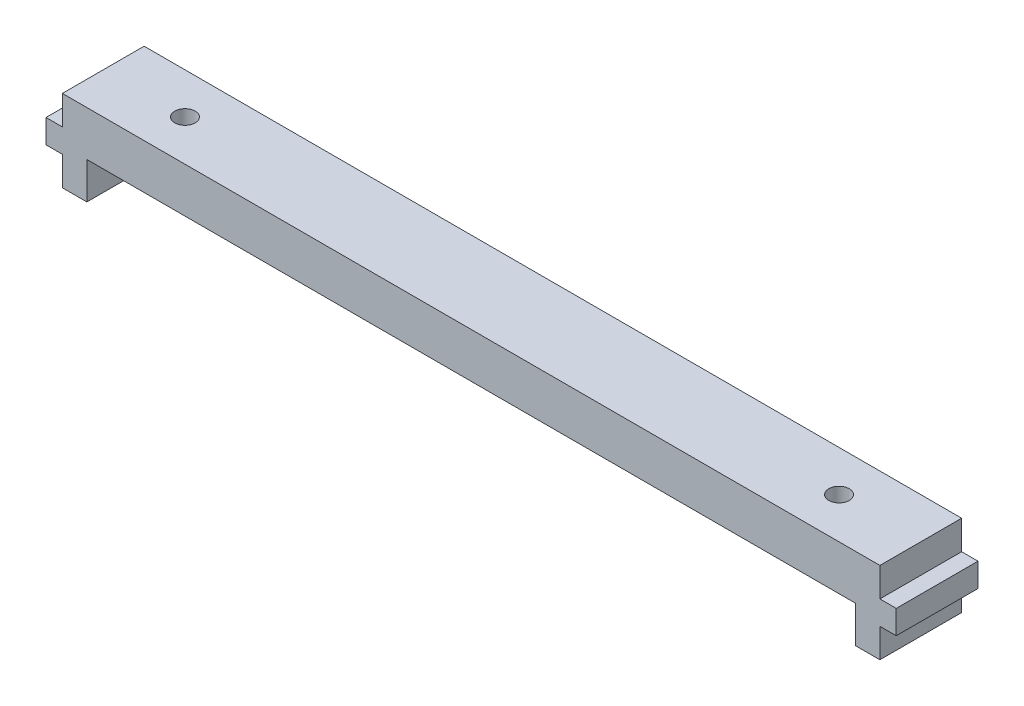
ISO-10303-21;
HEADER;
FILE_DESCRIPTION(('STEP AP214'),'2;1');
FILE_NAME('part.step','',(''),(''),'','','');
FILE_SCHEMA(('AUTOMOTIVE_DESIGN { 1 0 10303 214 1 1 1 1 }'));
ENDSEC;
DATA;
#1=APPLICATION_CONTEXT('core data for automotive mechanical design processes');
#2=APPLICATION_PROTOCOL_DEFINITION('international standard','automotive_design',2000,#1);
#3=PRODUCT_CONTEXT('',#1,'mechanical');
#4=PRODUCT('Part','Part','',(#3));
#5=PRODUCT_RELATED_PRODUCT_CATEGORY('part','',(#4));
#6=PRODUCT_DEFINITION_FORMATION('','',#4);
#7=PRODUCT_DEFINITION_CONTEXT('part definition',#1,'design');
#8=PRODUCT_DEFINITION('design','',#6,#7);
#9=PRODUCT_DEFINITION_SHAPE('','',#8);
#10=(LENGTH_UNIT() NAMED_UNIT(*) SI_UNIT(.MILLI.,.METRE.));
#11=(NAMED_UNIT(*) PLANE_ANGLE_UNIT() SI_UNIT($,.RADIAN.));
#12=(NAMED_UNIT(*) SI_UNIT($,.STERADIAN.) SOLID_ANGLE_UNIT());
#13=UNCERTAINTY_MEASURE_WITH_UNIT(LENGTH_MEASURE(1.E-05),#10,'distance_accuracy_value','');
#14=(GEOMETRIC_REPRESENTATION_CONTEXT(3) GLOBAL_UNCERTAINTY_ASSIGNED_CONTEXT((#13)) GLOBAL_UNIT_ASSIGNED_CONTEXT((#10,
#11,#12)) REPRESENTATION_CONTEXT('',''));
#15=CARTESIAN_POINT('',(0.,0.,0.));
#16=DIRECTION('',(0.,0.,1.));
#17=DIRECTION('',(1.,0.,0.));
#18=AXIS2_PLACEMENT_3D('',#15,#16,#17);
#19=CARTESIAN_POINT('',(-50.,5.5,10.));
#20=DIRECTION('',(0.,-1.,0.));
#21=DIRECTION('',(1.,0.,0.));
#22=AXIS2_PLACEMENT_3D('',#19,#20,#21);
#23=PLANE('',#22);
#24=CARTESIAN_POINT('',(40.,5.5,5.));
#25=DIRECTION('',(0.,1.,0.));
#26=DIRECTION('',(0.,0.,-1.));
#27=AXIS2_PLACEMENT_3D('',#24,#25,#26);
#28=CIRCLE('',#27,1.25);
#29=CARTESIAN_POINT('',(40.,5.5,3.75));
#30=VERTEX_POINT('',#29);
#31=EDGE_CURVE('E238',#30,#30,#28,.T.);
#32=ORIENTED_EDGE('',*,*,#31,.F.);
#33=EDGE_LOOP('',(#32));
#34=FACE_BOUND('',#33,.T.);
#35=CARTESIAN_POINT('',(-40.,5.5,5.));
#36=DIRECTION('',(0.,-1.,0.));
#37=DIRECTION('',(0.,0.,-1.));
#38=AXIS2_PLACEMENT_3D('',#35,#36,#37);
#39=CIRCLE('',#38,1.25);
#40=CARTESIAN_POINT('',(-40.,5.5,3.75));
#41=VERTEX_POINT('',#40);
#42=EDGE_CURVE('E139',#41,#41,#39,.T.);
#43=ORIENTED_EDGE('',*,*,#42,.T.);
#44=EDGE_LOOP('',(#43));
#45=FACE_BOUND('',#44,.T.);
#46=DIRECTION('',(-1.,0.,0.));
#47=VECTOR('',#46,1.);
#48=CARTESIAN_POINT('',(-50.,5.5,0.));
#49=LINE('',#48,#47);
#50=CARTESIAN_POINT('',(50.,5.5,0.));
#51=VERTEX_POINT('',#50);
#52=CARTESIAN_POINT('',(-50.,5.5,0.));
#53=VERTEX_POINT('',#52);
#54=EDGE_CURVE('E135',#51,#53,#49,.T.);
#55=ORIENTED_EDGE('',*,*,#54,.T.);
#56=DIRECTION('',(0.,0.,-1.));
#57=VECTOR('',#56,1.);
#58=CARTESIAN_POINT('',(-50.,5.5,10.));
#59=LINE('',#58,#57);
#60=CARTESIAN_POINT('',(-50.,5.5,10.));
#61=VERTEX_POINT('',#60);
#62=EDGE_CURVE('E11',#61,#53,#59,.T.);
#63=ORIENTED_EDGE('',*,*,#62,.F.);
#64=DIRECTION('',(-1.,0.,0.));
#65=VECTOR('',#64,1.);
#66=CARTESIAN_POINT('',(-50.,5.5,10.));
#67=LINE('',#66,#65);
#68=CARTESIAN_POINT('',(50.,5.5,10.));
#69=VERTEX_POINT('',#68);
#70=EDGE_CURVE('E153',#69,#61,#67,.T.);
#71=ORIENTED_EDGE('',*,*,#70,.F.);
#72=DIRECTION('',(0.,0.,-1.));
#73=VECTOR('',#72,1.);
#74=CARTESIAN_POINT('',(50.,5.5,10.));
#75=LINE('',#74,#73);
#76=EDGE_CURVE('E212',#69,#51,#75,.T.);
#77=ORIENTED_EDGE('',*,*,#76,.T.);
#78=EDGE_LOOP('',(#55,#63,#71,#77));
#79=FACE_BOUND('',#78,.T.);
#80=ADVANCED_FACE('F32',(#34,#45,#79),#23,.F.);
#81=CARTESIAN_POINT('',(-50.,5.5,10.));
#82=DIRECTION('',(1.,0.,0.));
#83=DIRECTION('',(0.,0.,-1.));
#84=AXIS2_PLACEMENT_3D('',#81,#82,#83);
#85=PLANE('',#84);
#86=DIRECTION('',(0.,-1.,0.));
#87=VECTOR('',#86,1.);
#88=CARTESIAN_POINT('',(-50.,5.5,0.));
#89=LINE('',#88,#87);
#90=CARTESIAN_POINT('',(-50.,1.95,0.));
#91=VERTEX_POINT('',#90);
#92=EDGE_CURVE('E138',#53,#91,#89,.T.);
#93=ORIENTED_EDGE('',*,*,#92,.T.);
#94=DIRECTION('',(0.,0.,-1.));
#95=VECTOR('',#94,1.);
#96=CARTESIAN_POINT('',(-50.,1.95,10.));
#97=LINE('',#96,#95);
#98=CARTESIAN_POINT('',(-50.,1.95,10.));
#99=VERTEX_POINT('',#98);
#100=EDGE_CURVE('E40',#99,#91,#97,.T.);
#101=ORIENTED_EDGE('',*,*,#100,.F.);
#102=DIRECTION('',(0.,-1.,0.));
#103=VECTOR('',#102,1.);
#104=CARTESIAN_POINT('',(-50.,5.5,10.));
#105=LINE('',#104,#103);
#106=EDGE_CURVE('E92',#61,#99,#105,.T.);
#107=ORIENTED_EDGE('',*,*,#106,.F.);
#108=ORIENTED_EDGE('',*,*,#62,.T.);
#109=EDGE_LOOP('',(#93,#101,#107,#108));
#110=FACE_BOUND('',#109,.T.);
#111=ADVANCED_FACE('F269',(#110),#85,.F.);
#112=CARTESIAN_POINT('',(-50.,1.95,10.));
#113=DIRECTION('',(0.,-1.,0.));
#114=DIRECTION('',(1.,0.,0.));
#115=AXIS2_PLACEMENT_3D('',#112,#113,#114);
#116=PLANE('',#115);
#117=DIRECTION('',(-1.,0.,0.));
#118=VECTOR('',#117,1.);
#119=CARTESIAN_POINT('',(-50.,1.95,0.));
#120=LINE('',#119,#118);
#121=CARTESIAN_POINT('',(-52.,1.95,0.));
#122=VERTEX_POINT('',#121);
#123=EDGE_CURVE('E141',#91,#122,#120,.T.);
#124=ORIENTED_EDGE('',*,*,#123,.T.);
#125=DIRECTION('',(0.,0.,-1.));
#126=VECTOR('',#125,1.);
#127=CARTESIAN_POINT('',(-52.,1.95,10.));
#128=LINE('',#127,#126);
#129=CARTESIAN_POINT('',(-52.,1.95,10.));
#130=VERTEX_POINT('',#129);
#131=EDGE_CURVE('E160',#130,#122,#128,.T.);
#132=ORIENTED_EDGE('',*,*,#131,.F.);
#133=DIRECTION('',(-1.,0.,0.));
#134=VECTOR('',#133,1.);
#135=CARTESIAN_POINT('',(-50.,1.95,10.));
#136=LINE('',#135,#134);
#137=EDGE_CURVE('E168',#99,#130,#136,.T.);
#138=ORIENTED_EDGE('',*,*,#137,.F.);
#139=ORIENTED_EDGE('',*,*,#100,.T.);
#140=EDGE_LOOP('',(#124,#132,#138,#139));
#141=FACE_BOUND('',#140,.T.);
#142=ADVANCED_FACE('F166',(#141),#116,.F.);
#143=CARTESIAN_POINT('',(-52.,1.95,10.));
#144=DIRECTION('',(1.,0.,0.));
#145=DIRECTION('',(0.,0.,-1.));
#146=AXIS2_PLACEMENT_3D('',#143,#144,#145);
#147=PLANE('',#146);
#148=DIRECTION('',(0.,-1.,0.));
#149=VECTOR('',#148,1.);
#150=CARTESIAN_POINT('',(-52.,1.95,0.));
#151=LINE('',#150,#149);
#152=CARTESIAN_POINT('',(-52.,-0.949999999999999,0.));
#153=VERTEX_POINT('',#152);
#154=EDGE_CURVE('E143',#122,#153,#151,.T.);
#155=ORIENTED_EDGE('',*,*,#154,.T.);
#156=DIRECTION('',(0.,0.,-1.));
#157=VECTOR('',#156,1.);
#158=CARTESIAN_POINT('',(-52.,-0.949999999999999,10.));
#159=LINE('',#158,#157);
#160=CARTESIAN_POINT('',(-52.,-0.949999999999999,10.));
#161=VERTEX_POINT('',#160);
#162=EDGE_CURVE('E157',#161,#153,#159,.T.);
#163=ORIENTED_EDGE('',*,*,#162,.F.);
#164=DIRECTION('',(0.,-1.,0.));
#165=VECTOR('',#164,1.);
#166=CARTESIAN_POINT('',(-52.,1.95,10.));
#167=LINE('',#166,#165);
#168=EDGE_CURVE('E180',#130,#161,#167,.T.);
#169=ORIENTED_EDGE('',*,*,#168,.F.);
#170=ORIENTED_EDGE('',*,*,#131,.T.);
#171=EDGE_LOOP('',(#155,#163,#169,#170));
#172=FACE_BOUND('',#171,.T.);
#173=ADVANCED_FACE('F176',(#172),#147,.F.);
#174=CARTESIAN_POINT('',(-52.,-0.949999999999999,10.));
#175=DIRECTION('',(0.,1.,0.));
#176=DIRECTION('',(-1.,0.,0.));
#177=AXIS2_PLACEMENT_3D('',#174,#175,#176);
#178=PLANE('',#177);
#179=DIRECTION('',(1.,0.,0.));
#180=VECTOR('',#179,1.);
#181=CARTESIAN_POINT('',(-52.,-0.949999999999999,0.));
#182=LINE('',#181,#180);
#183=CARTESIAN_POINT('',(-50.,-0.949999999999999,0.));
#184=VERTEX_POINT('',#183);
#185=EDGE_CURVE('E145',#153,#184,#182,.T.);
#186=ORIENTED_EDGE('',*,*,#185,.T.);
#187=DIRECTION('',(0.,0.,-1.));
#188=VECTOR('',#187,1.);
#189=CARTESIAN_POINT('',(-50.,-0.949999999999999,10.));
#190=LINE('',#189,#188);
#191=CARTESIAN_POINT('',(-50.,-0.949999999999999,10.));
#192=VERTEX_POINT('',#191);
#193=EDGE_CURVE('E124',#192,#184,#190,.T.);
#194=ORIENTED_EDGE('',*,*,#193,.F.);
#195=DIRECTION('',(1.,0.,0.));
#196=VECTOR('',#195,1.);
#197=CARTESIAN_POINT('',(-52.,-0.949999999999999,10.));
#198=LINE('',#197,#196);
#199=EDGE_CURVE('E115',#161,#192,#198,.T.);
#200=ORIENTED_EDGE('',*,*,#199,.F.);
#201=ORIENTED_EDGE('',*,*,#162,.T.);
#202=EDGE_LOOP('',(#186,#194,#200,#201));
#203=FACE_BOUND('',#202,.T.);
#204=ADVANCED_FACE('F179',(#203),#178,.F.);
#205=CARTESIAN_POINT('',(-50.,-0.949999999999999,10.));
#206=DIRECTION('',(1.,0.,0.));
#207=DIRECTION('',(0.,0.,-1.));
#208=AXIS2_PLACEMENT_3D('',#205,#206,#207);
#209=PLANE('',#208);
#210=DIRECTION('',(0.,-1.,0.));
#211=VECTOR('',#210,1.);
#212=CARTESIAN_POINT('',(-50.,-0.949999999999999,0.));
#213=LINE('',#212,#211);
#214=CARTESIAN_POINT('',(-50.,-4.5,0.));
#215=VERTEX_POINT('',#214);
#216=EDGE_CURVE('E123',#184,#215,#213,.T.);
#217=ORIENTED_EDGE('',*,*,#216,.T.);
#218=DIRECTION('',(0.,0.,-1.));
#219=VECTOR('',#218,1.);
#220=CARTESIAN_POINT('',(-50.,-4.5,10.));
#221=LINE('',#220,#219);
#222=CARTESIAN_POINT('',(-50.,-4.5,10.));
#223=VERTEX_POINT('',#222);
#224=EDGE_CURVE('E120',#223,#215,#221,.T.);
#225=ORIENTED_EDGE('',*,*,#224,.F.);
#226=DIRECTION('',(0.,-1.,0.));
#227=VECTOR('',#226,1.);
#228=CARTESIAN_POINT('',(-50.,-0.949999999999999,10.));
#229=LINE('',#228,#227);
#230=EDGE_CURVE('E109',#192,#223,#229,.T.);
#231=ORIENTED_EDGE('',*,*,#230,.F.);
#232=ORIENTED_EDGE('',*,*,#193,.T.);
#233=EDGE_LOOP('',(#217,#225,#231,#232));
#234=FACE_BOUND('',#233,.T.);
#235=ADVANCED_FACE('F121',(#234),#209,.F.);
#236=CARTESIAN_POINT('',(-50.,-4.5,10.));
#237=DIRECTION('',(0.,1.,0.));
#238=DIRECTION('',(-1.,0.,0.));
#239=AXIS2_PLACEMENT_3D('',#236,#237,#238);
#240=PLANE('',#239);
#241=DIRECTION('',(1.,0.,0.));
#242=VECTOR('',#241,1.);
#243=CARTESIAN_POINT('',(-50.,-4.5,0.));
#244=LINE('',#243,#242);
#245=CARTESIAN_POINT('',(-47.,-4.5,0.));
#246=VERTEX_POINT('',#245);
#247=EDGE_CURVE('E78',#215,#246,#244,.T.);
#248=ORIENTED_EDGE('',*,*,#247,.T.);
#249=DIRECTION('',(0.,0.,-1.));
#250=VECTOR('',#249,1.);
#251=CARTESIAN_POINT('',(-47.,-4.5,10.));
#252=LINE('',#251,#250);
#253=CARTESIAN_POINT('',(-47.,-4.5,10.));
#254=VERTEX_POINT('',#253);
#255=EDGE_CURVE('E125',#254,#246,#252,.T.);
#256=ORIENTED_EDGE('',*,*,#255,.F.);
#257=DIRECTION('',(1.,0.,0.));
#258=VECTOR('',#257,1.);
#259=CARTESIAN_POINT('',(-50.,-4.5,10.));
#260=LINE('',#259,#258);
#261=EDGE_CURVE('E113',#223,#254,#260,.T.);
#262=ORIENTED_EDGE('',*,*,#261,.F.);
#263=ORIENTED_EDGE('',*,*,#224,.T.);
#264=EDGE_LOOP('',(#248,#256,#262,#263));
#265=FACE_BOUND('',#264,.T.);
#266=ADVANCED_FACE('F127',(#265),#240,.F.);
#267=CARTESIAN_POINT('',(-47.,-4.5,10.));
#268=DIRECTION('',(-1.,0.,0.));
#269=DIRECTION('',(0.,0.,1.));
#270=AXIS2_PLACEMENT_3D('',#267,#268,#269);
#271=PLANE('',#270);
#272=DIRECTION('',(0.,1.,0.));
#273=VECTOR('',#272,1.);
#274=CARTESIAN_POINT('',(-47.,-4.5,0.));
#275=LINE('',#274,#273);
#276=CARTESIAN_POINT('',(-47.,0.,0.));
#277=VERTEX_POINT('',#276);
#278=EDGE_CURVE('E84',#246,#277,#275,.T.);
#279=ORIENTED_EDGE('',*,*,#278,.T.);
#280=DIRECTION('',(0.,0.,-1.));
#281=VECTOR('',#280,1.);
#282=CARTESIAN_POINT('',(-47.,0.,10.));
#283=LINE('',#282,#281);
#284=CARTESIAN_POINT('',(-47.,0.,10.));
#285=VERTEX_POINT('',#284);
#286=EDGE_CURVE('E134',#285,#277,#283,.T.);
#287=ORIENTED_EDGE('',*,*,#286,.F.);
#288=DIRECTION('',(0.,1.,0.));
#289=VECTOR('',#288,1.);
#290=CARTESIAN_POINT('',(-47.,-4.5,10.));
#291=LINE('',#290,#289);
#292=EDGE_CURVE('E48',#254,#285,#291,.T.);
#293=ORIENTED_EDGE('',*,*,#292,.F.);
#294=ORIENTED_EDGE('',*,*,#255,.T.);
#295=EDGE_LOOP('',(#279,#287,#293,#294));
#296=FACE_BOUND('',#295,.T.);
#297=ADVANCED_FACE('F341',(#296),#271,.F.);
#298=CARTESIAN_POINT('',(-47.,0.,10.));
#299=DIRECTION('',(0.,1.,0.));
#300=DIRECTION('',(0.,0.,1.));
#301=AXIS2_PLACEMENT_3D('',#298,#299,#300);
#302=PLANE('',#301);
#303=CARTESIAN_POINT('',(40.,0.,5.));
#304=DIRECTION('',(0.,1.,0.));
#305=DIRECTION('',(0.,0.,-1.));
#306=AXIS2_PLACEMENT_3D('',#303,#304,#305);
#307=CIRCLE('',#306,1.25);
#308=CARTESIAN_POINT('',(40.,0.,3.75));
#309=VERTEX_POINT('',#308);
#310=EDGE_CURVE('E258',#309,#309,#307,.T.);
#311=ORIENTED_EDGE('',*,*,#310,.T.);
#312=EDGE_LOOP('',(#311));
#313=FACE_BOUND('',#312,.T.);
#314=CARTESIAN_POINT('',(-40.,0.,5.));
#315=DIRECTION('',(0.,-1.,0.));
#316=DIRECTION('',(0.,0.,-1.));
#317=AXIS2_PLACEMENT_3D('',#314,#315,#316);
#318=CIRCLE('',#317,1.25);
#319=CARTESIAN_POINT('',(-40.,0.,3.75));
#320=VERTEX_POINT('',#319);
#321=EDGE_CURVE('E186',#320,#320,#318,.T.);
#322=ORIENTED_EDGE('',*,*,#321,.F.);
#323=EDGE_LOOP('',(#322));
#324=FACE_BOUND('',#323,.T.);
#325=DIRECTION('',(1.,0.,0.));
#326=VECTOR('',#325,1.);
#327=CARTESIAN_POINT('',(-47.,0.,0.));
#328=LINE('',#327,#326);
#329=CARTESIAN_POINT('',(47.,0.,0.));
#330=VERTEX_POINT('',#329);
#331=EDGE_CURVE('E150',#277,#330,#328,.T.);
#332=ORIENTED_EDGE('',*,*,#331,.T.);
#333=DIRECTION('',(0.,0.,-1.));
#334=VECTOR('',#333,1.);
#335=CARTESIAN_POINT('',(47.,0.,10.));
#336=LINE('',#335,#334);
#337=CARTESIAN_POINT('',(47.,0.,10.));
#338=VERTEX_POINT('',#337);
#339=EDGE_CURVE('E189',#338,#330,#336,.T.);
#340=ORIENTED_EDGE('',*,*,#339,.F.);
#341=DIRECTION('',(1.,0.,0.));
#342=VECTOR('',#341,1.);
#343=CARTESIAN_POINT('',(-47.,0.,10.));
#344=LINE('',#343,#342);
#345=EDGE_CURVE('E129',#285,#338,#344,.T.);
#346=ORIENTED_EDGE('',*,*,#345,.F.);
#347=ORIENTED_EDGE('',*,*,#286,.T.);
#348=EDGE_LOOP('',(#332,#340,#346,#347));
#349=FACE_BOUND('',#348,.T.);
#350=ADVANCED_FACE('F340',(#313,#324,#349),#302,.F.);
#351=CARTESIAN_POINT('',(0.,0.,10.));
#352=DIRECTION('',(0.,0.,-1.));
#353=DIRECTION('',(-1.,0.,0.));
#354=AXIS2_PLACEMENT_3D('',#351,#352,#353);
#355=PLANE('',#354);
#356=ORIENTED_EDGE('',*,*,#70,.T.);
#357=ORIENTED_EDGE('',*,*,#106,.T.);
#358=ORIENTED_EDGE('',*,*,#137,.T.);
#359=ORIENTED_EDGE('',*,*,#168,.T.);
#360=ORIENTED_EDGE('',*,*,#199,.T.);
#361=ORIENTED_EDGE('',*,*,#230,.T.);
#362=ORIENTED_EDGE('',*,*,#261,.T.);
#363=ORIENTED_EDGE('',*,*,#292,.T.);
#364=ORIENTED_EDGE('',*,*,#345,.T.);
#365=DIRECTION('',(0.,1.,0.));
#366=VECTOR('',#365,1.);
#367=CARTESIAN_POINT('',(47.,-4.5,10.));
#368=LINE('',#367,#366);
#369=CARTESIAN_POINT('',(47.,-4.5,10.));
#370=VERTEX_POINT('',#369);
#371=EDGE_CURVE('E219',#370,#338,#368,.T.);
#372=ORIENTED_EDGE('',*,*,#371,.F.);
#373=DIRECTION('',(-1.,0.,0.));
#374=VECTOR('',#373,1.);
#375=CARTESIAN_POINT('',(50.,-4.5,10.));
#376=LINE('',#375,#374);
#377=CARTESIAN_POINT('',(50.,-4.5,10.));
#378=VERTEX_POINT('',#377);
#379=EDGE_CURVE('E253',#378,#370,#376,.T.);
#380=ORIENTED_EDGE('',*,*,#379,.F.);
#381=DIRECTION('',(0.,-1.,0.));
#382=VECTOR('',#381,1.);
#383=CARTESIAN_POINT('',(50.,-0.949999999999999,10.));
#384=LINE('',#383,#382);
#385=CARTESIAN_POINT('',(50.,-0.949999999999999,10.));
#386=VERTEX_POINT('',#385);
#387=EDGE_CURVE('E250',#386,#378,#384,.T.);
#388=ORIENTED_EDGE('',*,*,#387,.F.);
#389=DIRECTION('',(-1.,0.,0.));
#390=VECTOR('',#389,1.);
#391=CARTESIAN_POINT('',(52.,-0.949999999999999,10.));
#392=LINE('',#391,#390);
#393=CARTESIAN_POINT('',(52.,-0.949999999999999,10.));
#394=VERTEX_POINT('',#393);
#395=EDGE_CURVE('E247',#394,#386,#392,.T.);
#396=ORIENTED_EDGE('',*,*,#395,.F.);
#397=DIRECTION('',(0.,-1.,0.));
#398=VECTOR('',#397,1.);
#399=CARTESIAN_POINT('',(52.,1.95,10.));
#400=LINE('',#399,#398);
#401=CARTESIAN_POINT('',(52.,1.95,10.));
#402=VERTEX_POINT('',#401);
#403=EDGE_CURVE('E244',#402,#394,#400,.T.);
#404=ORIENTED_EDGE('',*,*,#403,.F.);
#405=DIRECTION('',(1.,0.,0.));
#406=VECTOR('',#405,1.);
#407=CARTESIAN_POINT('',(50.,1.95,10.));
#408=LINE('',#407,#406);
#409=CARTESIAN_POINT('',(50.,1.95,10.));
#410=VERTEX_POINT('',#409);
#411=EDGE_CURVE('E241',#410,#402,#408,.T.);
#412=ORIENTED_EDGE('',*,*,#411,.F.);
#413=DIRECTION('',(0.,-1.,0.));
#414=VECTOR('',#413,1.);
#415=CARTESIAN_POINT('',(50.,5.5,10.));
#416=LINE('',#415,#414);
#417=EDGE_CURVE('E215',#69,#410,#416,.T.);
#418=ORIENTED_EDGE('',*,*,#417,.F.);
#419=EDGE_LOOP('',(#356,#357,#358,#359,#360,#361,#362,#363,#364,#372,#380,#388,#396,#404,#412,#418));
#420=FACE_BOUND('',#419,.T.);
#421=ADVANCED_FACE('F111',(#420),#355,.F.);
#422=CARTESIAN_POINT('',(0.,0.,0.));
#423=DIRECTION('',(0.,0.,-1.));
#424=DIRECTION('',(-1.,0.,0.));
#425=AXIS2_PLACEMENT_3D('',#422,#423,#424);
#426=PLANE('',#425);
#427=ORIENTED_EDGE('',*,*,#54,.F.);
#428=DIRECTION('',(0.,-1.,0.));
#429=VECTOR('',#428,1.);
#430=CARTESIAN_POINT('',(50.,5.5,0.));
#431=LINE('',#430,#429);
#432=CARTESIAN_POINT('',(50.,1.95,0.));
#433=VERTEX_POINT('',#432);
#434=EDGE_CURVE('E216',#51,#433,#431,.T.);
#435=ORIENTED_EDGE('',*,*,#434,.T.);
#436=DIRECTION('',(1.,0.,0.));
#437=VECTOR('',#436,1.);
#438=CARTESIAN_POINT('',(50.,1.95,0.));
#439=LINE('',#438,#437);
#440=CARTESIAN_POINT('',(52.,1.95,0.));
#441=VERTEX_POINT('',#440);
#442=EDGE_CURVE('E220',#433,#441,#439,.T.);
#443=ORIENTED_EDGE('',*,*,#442,.T.);
#444=DIRECTION('',(0.,-1.,0.));
#445=VECTOR('',#444,1.);
#446=CARTESIAN_POINT('',(52.,1.95,0.));
#447=LINE('',#446,#445);
#448=CARTESIAN_POINT('',(52.,-0.949999999999999,0.));
#449=VERTEX_POINT('',#448);
#450=EDGE_CURVE('E223',#441,#449,#447,.T.);
#451=ORIENTED_EDGE('',*,*,#450,.T.);
#452=DIRECTION('',(-1.,0.,0.));
#453=VECTOR('',#452,1.);
#454=CARTESIAN_POINT('',(52.,-0.949999999999999,0.));
#455=LINE('',#454,#453);
#456=CARTESIAN_POINT('',(50.,-0.949999999999999,0.));
#457=VERTEX_POINT('',#456);
#458=EDGE_CURVE('E226',#449,#457,#455,.T.);
#459=ORIENTED_EDGE('',*,*,#458,.T.);
#460=DIRECTION('',(0.,-1.,0.));
#461=VECTOR('',#460,1.);
#462=CARTESIAN_POINT('',(50.,-0.949999999999999,0.));
#463=LINE('',#462,#461);
#464=CARTESIAN_POINT('',(50.,-4.5,0.));
#465=VERTEX_POINT('',#464);
#466=EDGE_CURVE('E229',#457,#465,#463,.T.);
#467=ORIENTED_EDGE('',*,*,#466,.T.);
#468=DIRECTION('',(-1.,0.,0.));
#469=VECTOR('',#468,1.);
#470=CARTESIAN_POINT('',(50.,-4.5,0.));
#471=LINE('',#470,#469);
#472=CARTESIAN_POINT('',(47.,-4.5,0.));
#473=VERTEX_POINT('',#472);
#474=EDGE_CURVE('E232',#465,#473,#471,.T.);
#475=ORIENTED_EDGE('',*,*,#474,.T.);
#476=DIRECTION('',(0.,1.,0.));
#477=VECTOR('',#476,1.);
#478=CARTESIAN_POINT('',(47.,-4.5,0.));
#479=LINE('',#478,#477);
#480=EDGE_CURVE('E235',#473,#330,#479,.T.);
#481=ORIENTED_EDGE('',*,*,#480,.T.);
#482=ORIENTED_EDGE('',*,*,#331,.F.);
#483=ORIENTED_EDGE('',*,*,#278,.F.);
#484=ORIENTED_EDGE('',*,*,#247,.F.);
#485=ORIENTED_EDGE('',*,*,#216,.F.);
#486=ORIENTED_EDGE('',*,*,#185,.F.);
#487=ORIENTED_EDGE('',*,*,#154,.F.);
#488=ORIENTED_EDGE('',*,*,#123,.F.);
#489=ORIENTED_EDGE('',*,*,#92,.F.);
#490=EDGE_LOOP('',(#427,#435,#443,#451,#459,#467,#475,#481,#482,#483,#484,#485,#486,#487,#488,#489));
#491=FACE_BOUND('',#490,.T.);
#492=ADVANCED_FACE('F172',(#491),#426,.T.);
#493=CARTESIAN_POINT('',(-40.,5.5,5.));
#494=DIRECTION('',(0.,-1.,0.));
#495=DIRECTION('',(0.,0.,-1.));
#496=AXIS2_PLACEMENT_3D('',#493,#494,#495);
#497=CYLINDRICAL_SURFACE('',#496,1.25);
#498=ORIENTED_EDGE('',*,*,#42,.F.);
#499=EDGE_LOOP('',(#498));
#500=FACE_BOUND('',#499,.T.);
#501=ORIENTED_EDGE('',*,*,#321,.T.);
#502=EDGE_LOOP('',(#501));
#503=FACE_BOUND('',#502,.T.);
#504=ADVANCED_FACE('F395',(#500,#503),#497,.F.);
#505=CARTESIAN_POINT('',(47.,-4.5,10.));
#506=DIRECTION('',(-1.,0.,0.));
#507=DIRECTION('',(0.,0.,1.));
#508=AXIS2_PLACEMENT_3D('',#505,#506,#507);
#509=PLANE('',#508);
#510=ORIENTED_EDGE('',*,*,#480,.F.);
#511=DIRECTION('',(0.,0.,-1.));
#512=VECTOR('',#511,1.);
#513=CARTESIAN_POINT('',(47.,-4.5,10.));
#514=LINE('',#513,#512);
#515=EDGE_CURVE('E194',#370,#473,#514,.T.);
#516=ORIENTED_EDGE('',*,*,#515,.F.);
#517=ORIENTED_EDGE('',*,*,#371,.T.);
#518=ORIENTED_EDGE('',*,*,#339,.T.);
#519=EDGE_LOOP('',(#510,#516,#517,#518));
#520=FACE_BOUND('',#519,.T.);
#521=ADVANCED_FACE('F315',(#520),#509,.T.);
#522=CARTESIAN_POINT('',(50.,-4.5,10.));
#523=DIRECTION('',(0.,-1.,0.));
#524=DIRECTION('',(1.,0.,0.));
#525=AXIS2_PLACEMENT_3D('',#522,#523,#524);
#526=PLANE('',#525);
#527=ORIENTED_EDGE('',*,*,#474,.F.);
#528=DIRECTION('',(0.,0.,-1.));
#529=VECTOR('',#528,1.);
#530=CARTESIAN_POINT('',(50.,-4.5,10.));
#531=LINE('',#530,#529);
#532=EDGE_CURVE('E197',#378,#465,#531,.T.);
#533=ORIENTED_EDGE('',*,*,#532,.F.);
#534=ORIENTED_EDGE('',*,*,#379,.T.);
#535=ORIENTED_EDGE('',*,*,#515,.T.);
#536=EDGE_LOOP('',(#527,#533,#534,#535));
#537=FACE_BOUND('',#536,.T.);
#538=ADVANCED_FACE('F322',(#537),#526,.T.);
#539=CARTESIAN_POINT('',(50.,-0.949999999999999,10.));
#540=DIRECTION('',(1.,0.,0.));
#541=DIRECTION('',(0.,0.,-1.));
#542=AXIS2_PLACEMENT_3D('',#539,#540,#541);
#543=PLANE('',#542);
#544=ORIENTED_EDGE('',*,*,#466,.F.);
#545=DIRECTION('',(0.,0.,-1.));
#546=VECTOR('',#545,1.);
#547=CARTESIAN_POINT('',(50.,-0.949999999999999,10.));
#548=LINE('',#547,#546);
#549=EDGE_CURVE('E200',#386,#457,#548,.T.);
#550=ORIENTED_EDGE('',*,*,#549,.F.);
#551=ORIENTED_EDGE('',*,*,#387,.T.);
#552=ORIENTED_EDGE('',*,*,#532,.T.);
#553=EDGE_LOOP('',(#544,#550,#551,#552));
#554=FACE_BOUND('',#553,.T.);
#555=ADVANCED_FACE('F325',(#554),#543,.T.);
#556=CARTESIAN_POINT('',(52.,-0.949999999999999,10.));
#557=DIRECTION('',(0.,-1.,0.));
#558=DIRECTION('',(1.,0.,0.));
#559=AXIS2_PLACEMENT_3D('',#556,#557,#558);
#560=PLANE('',#559);
#561=ORIENTED_EDGE('',*,*,#458,.F.);
#562=DIRECTION('',(0.,0.,-1.));
#563=VECTOR('',#562,1.);
#564=CARTESIAN_POINT('',(52.,-0.949999999999999,10.));
#565=LINE('',#564,#563);
#566=EDGE_CURVE('E203',#394,#449,#565,.T.);
#567=ORIENTED_EDGE('',*,*,#566,.F.);
#568=ORIENTED_EDGE('',*,*,#395,.T.);
#569=ORIENTED_EDGE('',*,*,#549,.T.);
#570=EDGE_LOOP('',(#561,#567,#568,#569));
#571=FACE_BOUND('',#570,.T.);
#572=ADVANCED_FACE('F330',(#571),#560,.T.);
#573=CARTESIAN_POINT('',(52.,1.95,10.));
#574=DIRECTION('',(1.,0.,0.));
#575=DIRECTION('',(0.,0.,-1.));
#576=AXIS2_PLACEMENT_3D('',#573,#574,#575);
#577=PLANE('',#576);
#578=ORIENTED_EDGE('',*,*,#450,.F.);
#579=DIRECTION('',(0.,0.,-1.));
#580=VECTOR('',#579,1.);
#581=CARTESIAN_POINT('',(52.,1.95,10.));
#582=LINE('',#581,#580);
#583=EDGE_CURVE('E206',#402,#441,#582,.T.);
#584=ORIENTED_EDGE('',*,*,#583,.F.);
#585=ORIENTED_EDGE('',*,*,#403,.T.);
#586=ORIENTED_EDGE('',*,*,#566,.T.);
#587=EDGE_LOOP('',(#578,#584,#585,#586));
#588=FACE_BOUND('',#587,.T.);
#589=ADVANCED_FACE('F333',(#588),#577,.T.);
#590=CARTESIAN_POINT('',(50.,1.95,10.));
#591=DIRECTION('',(0.,1.,0.));
#592=DIRECTION('',(-1.,0.,0.));
#593=AXIS2_PLACEMENT_3D('',#590,#591,#592);
#594=PLANE('',#593);
#595=ORIENTED_EDGE('',*,*,#442,.F.);
#596=DIRECTION('',(0.,0.,-1.));
#597=VECTOR('',#596,1.);
#598=CARTESIAN_POINT('',(50.,1.95,10.));
#599=LINE('',#598,#597);
#600=EDGE_CURVE('E209',#410,#433,#599,.T.);
#601=ORIENTED_EDGE('',*,*,#600,.F.);
#602=ORIENTED_EDGE('',*,*,#411,.T.);
#603=ORIENTED_EDGE('',*,*,#583,.T.);
#604=EDGE_LOOP('',(#595,#601,#602,#603));
#605=FACE_BOUND('',#604,.T.);
#606=ADVANCED_FACE('F337',(#605),#594,.T.);
#607=CARTESIAN_POINT('',(50.,5.5,10.));
#608=DIRECTION('',(1.,0.,0.));
#609=DIRECTION('',(0.,0.,-1.));
#610=AXIS2_PLACEMENT_3D('',#607,#608,#609);
#611=PLANE('',#610);
#612=ORIENTED_EDGE('',*,*,#434,.F.);
#613=ORIENTED_EDGE('',*,*,#76,.F.);
#614=ORIENTED_EDGE('',*,*,#417,.T.);
#615=ORIENTED_EDGE('',*,*,#600,.T.);
#616=EDGE_LOOP('',(#612,#613,#614,#615));
#617=FACE_BOUND('',#616,.T.);
#618=ADVANCED_FACE('F477',(#617),#611,.T.);
#619=CARTESIAN_POINT('',(40.,5.5,5.));
#620=DIRECTION('',(0.,-1.,0.));
#621=DIRECTION('',(0.,0.,-1.));
#622=AXIS2_PLACEMENT_3D('',#619,#620,#621);
#623=CYLINDRICAL_SURFACE('',#622,1.25);
#624=ORIENTED_EDGE('',*,*,#31,.T.);
#625=EDGE_LOOP('',(#624));
#626=FACE_BOUND('',#625,.T.);
#627=ORIENTED_EDGE('',*,*,#310,.F.);
#628=EDGE_LOOP('',(#627));
#629=FACE_BOUND('',#628,.T.);
#630=ADVANCED_FACE('F264',(#626,#629),#623,.F.);
#631=CLOSED_SHELL('',(#80,#111,#142,#173,#204,#235,#266,#297,#350,#421,#492,#504,#521,#538,#555,
#572,#589,#606,#618,#630));
#632=MANIFOLD_SOLID_BREP('B2',#631);
#633=ADVANCED_BREP_SHAPE_REPRESENTATION('',(#18,#632),#14);
#634=SHAPE_DEFINITION_REPRESENTATION(#9,#633);
ENDSEC;
END-ISO-10303-21;
